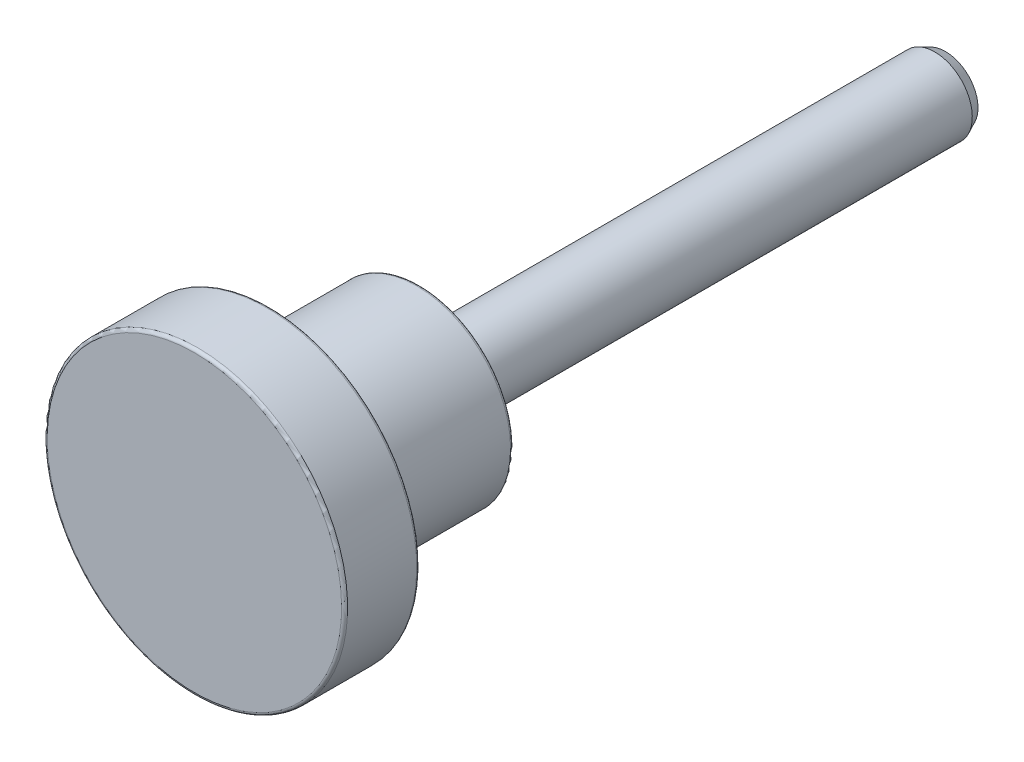
ISO-10303-21;
HEADER;
FILE_DESCRIPTION(('STEP AP214'),'2;1');
FILE_NAME('part.step','',(''),(''),'','','');
FILE_SCHEMA(('AUTOMOTIVE_DESIGN { 1 0 10303 214 1 1 1 1 }'));
ENDSEC;
DATA;
#1=APPLICATION_CONTEXT('core data for automotive mechanical design processes');
#2=APPLICATION_PROTOCOL_DEFINITION('international standard','automotive_design',2000,#1);
#3=PRODUCT_CONTEXT('',#1,'mechanical');
#4=PRODUCT('Part','Part','',(#3));
#5=PRODUCT_RELATED_PRODUCT_CATEGORY('part','',(#4));
#6=PRODUCT_DEFINITION_FORMATION('','',#4);
#7=PRODUCT_DEFINITION_CONTEXT('part definition',#1,'design');
#8=PRODUCT_DEFINITION('design','',#6,#7);
#9=PRODUCT_DEFINITION_SHAPE('','',#8);
#10=(LENGTH_UNIT() NAMED_UNIT(*) SI_UNIT(.MILLI.,.METRE.));
#11=(NAMED_UNIT(*) PLANE_ANGLE_UNIT() SI_UNIT($,.RADIAN.));
#12=(NAMED_UNIT(*) SI_UNIT($,.STERADIAN.) SOLID_ANGLE_UNIT());
#13=UNCERTAINTY_MEASURE_WITH_UNIT(LENGTH_MEASURE(1.E-05),#10,'distance_accuracy_value','');
#14=(GEOMETRIC_REPRESENTATION_CONTEXT(3) GLOBAL_UNCERTAINTY_ASSIGNED_CONTEXT((#13)) GLOBAL_UNIT_ASSIGNED_CONTEXT((#10,
#11,#12)) REPRESENTATION_CONTEXT('',''));
#15=CARTESIAN_POINT('',(0.,0.,0.));
#16=DIRECTION('',(0.,0.,1.));
#17=DIRECTION('',(1.,0.,0.));
#18=AXIS2_PLACEMENT_3D('',#15,#16,#17);
#19=CARTESIAN_POINT('',(0.,0.,8.5598));
#20=DIRECTION('',(0.,0.,-1.));
#21=DIRECTION('',(0.,1.,0.));
#22=AXIS2_PLACEMENT_3D('',#19,#20,#21);
#23=CYLINDRICAL_SURFACE('',#22,3.175);
#24=CARTESIAN_POINT('',(0.,0.,22.225));
#25=DIRECTION('',(0.,0.,1.));
#26=DIRECTION('',(0.,-1.,0.));
#27=AXIS2_PLACEMENT_3D('',#24,#25,#26);
#28=CIRCLE('',#27,3.175);
#29=CARTESIAN_POINT('',(0.,-3.175,22.225));
#30=VERTEX_POINT('',#29);
#31=EDGE_CURVE('E60',#30,#30,#28,.F.);
#32=ORIENTED_EDGE('',*,*,#31,.T.);
#33=EDGE_LOOP('',(#32));
#34=FACE_BOUND('',#33,.T.);
#35=CARTESIAN_POINT('',(0.,0.,-21.3178571428572));
#36=DIRECTION('',(0.,0.,1.));
#37=DIRECTION('',(0.,-1.,0.));
#38=AXIS2_PLACEMENT_3D('',#35,#36,#37);
#39=CIRCLE('',#38,3.175);
#40=CARTESIAN_POINT('',(0.,-3.17500000000001,-21.3178571428572));
#41=VERTEX_POINT('',#40);
#42=EDGE_CURVE('E69',#41,#41,#39,.T.);
#43=ORIENTED_EDGE('',*,*,#42,.T.);
#44=EDGE_LOOP('',(#43));
#45=FACE_BOUND('',#44,.T.);
#46=ADVANCED_FACE('F34',(#34,#45),#23,.T.);
#47=CARTESIAN_POINT('',(0.,7.9375,22.225));
#48=DIRECTION('',(0.,0.,1.));
#49=DIRECTION('',(0.,-1.,0.));
#50=AXIS2_PLACEMENT_3D('',#47,#48,#49);
#51=PLANE('',#50);
#52=CARTESIAN_POINT('',(0.,0.,22.225));
#53=DIRECTION('',(0.,0.,1.));
#54=DIRECTION('',(0.,-1.,0.));
#55=AXIS2_PLACEMENT_3D('',#52,#53,#54);
#56=CIRCLE('',#55,7.6835);
#57=CARTESIAN_POINT('',(0.,-7.6835,22.225));
#58=VERTEX_POINT('',#57);
#59=EDGE_CURVE('E54',#58,#58,#56,.F.);
#60=ORIENTED_EDGE('',*,*,#59,.T.);
#61=EDGE_LOOP('',(#60));
#62=FACE_BOUND('',#61,.T.);
#63=ORIENTED_EDGE('',*,*,#31,.F.);
#64=EDGE_LOOP('',(#63));
#65=FACE_BOUND('',#64,.T.);
#66=ADVANCED_FACE('F90',(#62,#65),#51,.F.);
#67=CARTESIAN_POINT('',(0.,0.,22.225));
#68=DIRECTION('',(0.,0.,1.));
#69=DIRECTION('',(0.,-1.,0.));
#70=AXIS2_PLACEMENT_3D('',#67,#68,#69);
#71=CYLINDRICAL_SURFACE('',#70,7.9375);
#72=CARTESIAN_POINT('',(0.,0.,22.479));
#73=DIRECTION('',(0.,0.,1.));
#74=DIRECTION('',(0.,-1.,0.));
#75=AXIS2_PLACEMENT_3D('',#72,#73,#74);
#76=CIRCLE('',#75,7.9375);
#77=CARTESIAN_POINT('',(0.,-7.9375,22.479));
#78=VERTEX_POINT('',#77);
#79=EDGE_CURVE('E57',#78,#78,#76,.T.);
#80=ORIENTED_EDGE('',*,*,#79,.T.);
#81=EDGE_LOOP('',(#80));
#82=FACE_BOUND('',#81,.T.);
#83=CARTESIAN_POINT('',(0.,0.,34.925));
#84=DIRECTION('',(0.,0.,1.));
#85=DIRECTION('',(0.,-1.,0.));
#86=AXIS2_PLACEMENT_3D('',#83,#84,#85);
#87=CIRCLE('',#86,7.9375);
#88=CARTESIAN_POINT('',(0.,-7.9375,34.925));
#89=VERTEX_POINT('',#88);
#90=EDGE_CURVE('E63',#89,#89,#87,.T.);
#91=ORIENTED_EDGE('',*,*,#90,.F.);
#92=EDGE_LOOP('',(#91));
#93=FACE_BOUND('',#92,.T.);
#94=ADVANCED_FACE('F96',(#82,#93),#71,.T.);
#95=CARTESIAN_POINT('',(0.,7.9375,34.925));
#96=DIRECTION('',(0.,0.,1.));
#97=DIRECTION('',(0.,-1.,0.));
#98=AXIS2_PLACEMENT_3D('',#95,#96,#97);
#99=PLANE('',#98);
#100=CARTESIAN_POINT('',(0.,0.,34.925));
#101=DIRECTION('',(0.,0.,1.));
#102=DIRECTION('',(0.,-1.,0.));
#103=AXIS2_PLACEMENT_3D('',#100,#101,#102);
#104=CIRCLE('',#103,12.446);
#105=CARTESIAN_POINT('',(0.,-12.446,34.925));
#106=VERTEX_POINT('',#105);
#107=EDGE_CURVE('E41',#106,#106,#104,.F.);
#108=ORIENTED_EDGE('',*,*,#107,.T.);
#109=EDGE_LOOP('',(#108));
#110=FACE_BOUND('',#109,.T.);
#111=ORIENTED_EDGE('',*,*,#90,.T.);
#112=EDGE_LOOP('',(#111));
#113=FACE_BOUND('',#112,.T.);
#114=ADVANCED_FACE('F115',(#110,#113),#99,.F.);
#115=CARTESIAN_POINT('',(0.,0.,22.225));
#116=DIRECTION('',(0.,0.,1.));
#117=DIRECTION('',(0.,-1.,0.));
#118=AXIS2_PLACEMENT_3D('',#115,#116,#117);
#119=CYLINDRICAL_SURFACE('',#118,12.7);
#120=CARTESIAN_POINT('',(0.,0.,35.179));
#121=DIRECTION('',(0.,0.,1.));
#122=DIRECTION('',(0.,-1.,0.));
#123=AXIS2_PLACEMENT_3D('',#120,#121,#122);
#124=CIRCLE('',#123,12.7);
#125=CARTESIAN_POINT('',(0.,-12.7,35.179));
#126=VERTEX_POINT('',#125);
#127=EDGE_CURVE('E45',#126,#126,#124,.T.);
#128=ORIENTED_EDGE('',*,*,#127,.T.);
#129=EDGE_LOOP('',(#128));
#130=FACE_BOUND('',#129,.T.);
#131=CARTESIAN_POINT('',(0.,0.,41.021));
#132=DIRECTION('',(0.,0.,-1.));
#133=DIRECTION('',(0.,1.,0.));
#134=AXIS2_PLACEMENT_3D('',#131,#132,#133);
#135=CIRCLE('',#134,12.7);
#136=CARTESIAN_POINT('',(0.,12.7,41.021));
#137=VERTEX_POINT('',#136);
#138=EDGE_CURVE('E49',#137,#137,#135,.T.);
#139=ORIENTED_EDGE('',*,*,#138,.T.);
#140=EDGE_LOOP('',(#139));
#141=FACE_BOUND('',#140,.T.);
#142=ADVANCED_FACE('F87',(#130,#141),#119,.T.);
#143=CARTESIAN_POINT('',(0.,12.7,41.275));
#144=DIRECTION('',(0.,0.,-1.));
#145=DIRECTION('',(0.,1.,0.));
#146=AXIS2_PLACEMENT_3D('',#143,#144,#145);
#147=PLANE('',#146);
#148=CARTESIAN_POINT('',(0.,0.,41.275));
#149=DIRECTION('',(0.,0.,-1.));
#150=DIRECTION('',(0.,1.,0.));
#151=AXIS2_PLACEMENT_3D('',#148,#149,#150);
#152=CIRCLE('',#151,12.446);
#153=CARTESIAN_POINT('',(0.,12.446,41.275));
#154=VERTEX_POINT('',#153);
#155=EDGE_CURVE('E11',#154,#154,#152,.F.);
#156=ORIENTED_EDGE('',*,*,#155,.T.);
#157=EDGE_LOOP('',(#156));
#158=FACE_BOUND('',#157,.T.);
#159=ADVANCED_FACE('F77',(#158),#147,.F.);
#160=CARTESIAN_POINT('',(0.,0.,-21.3178571428572));
#161=DIRECTION('',(0.,0.,1.));
#162=DIRECTION('',(0.,-1.,0.));
#163=AXIS2_PLACEMENT_3D('',#160,#161,#162);
#164=CONICAL_SURFACE('',#163,3.175,0.436332312998576);
#165=CARTESIAN_POINT('',(0.,0.,-22.225));
#166=DIRECTION('',(0.,0.,1.));
#167=DIRECTION('',(0.,-1.,0.));
#168=AXIS2_PLACEMENT_3D('',#165,#166,#167);
#169=CIRCLE('',#168,2.75199233867369);
#170=CARTESIAN_POINT('',(0.,-2.75199233867369,-22.225));
#171=VERTEX_POINT('',#170);
#172=EDGE_CURVE('E66',#171,#171,#169,.T.);
#173=ORIENTED_EDGE('',*,*,#172,.T.);
#174=EDGE_LOOP('',(#173));
#175=FACE_BOUND('',#174,.T.);
#176=ORIENTED_EDGE('',*,*,#42,.F.);
#177=EDGE_LOOP('',(#176));
#178=FACE_BOUND('',#177,.T.);
#179=ADVANCED_FACE('F74',(#175,#178),#164,.T.);
#180=CARTESIAN_POINT('',(0.,3.175,-22.225));
#181=DIRECTION('',(0.,0.,-1.));
#182=DIRECTION('',(0.,1.,0.));
#183=AXIS2_PLACEMENT_3D('',#180,#181,#182);
#184=PLANE('',#183);
#185=ORIENTED_EDGE('',*,*,#172,.F.);
#186=EDGE_LOOP('',(#185));
#187=FACE_BOUND('',#186,.T.);
#188=ADVANCED_FACE('F76',(#187),#184,.T.);
#189=CARTESIAN_POINT('',(0.,0.,22.479));
#190=DIRECTION('',(0.,0.,1.));
#191=DIRECTION('',(0.,-1.,0.));
#192=AXIS2_PLACEMENT_3D('',#189,#190,#191);
#193=TOROIDAL_SURFACE('',#192,7.6835,0.254);
#194=ORIENTED_EDGE('',*,*,#59,.F.);
#195=EDGE_LOOP('',(#194));
#196=FACE_BOUND('',#195,.T.);
#197=ORIENTED_EDGE('',*,*,#79,.F.);
#198=EDGE_LOOP('',(#197));
#199=FACE_BOUND('',#198,.T.);
#200=ADVANCED_FACE('F84',(#196,#199),#193,.T.);
#201=CARTESIAN_POINT('',(0.,0.,35.179));
#202=DIRECTION('',(0.,0.,1.));
#203=DIRECTION('',(0.,-1.,0.));
#204=AXIS2_PLACEMENT_3D('',#201,#202,#203);
#205=TOROIDAL_SURFACE('',#204,12.446,0.254);
#206=ORIENTED_EDGE('',*,*,#107,.F.);
#207=EDGE_LOOP('',(#206));
#208=FACE_BOUND('',#207,.T.);
#209=ORIENTED_EDGE('',*,*,#127,.F.);
#210=EDGE_LOOP('',(#209));
#211=FACE_BOUND('',#210,.T.);
#212=ADVANCED_FACE('F102',(#208,#211),#205,.T.);
#213=CARTESIAN_POINT('',(0.,0.,41.021));
#214=DIRECTION('',(0.,0.,-1.));
#215=DIRECTION('',(0.,1.,0.));
#216=AXIS2_PLACEMENT_3D('',#213,#214,#215);
#217=TOROIDAL_SURFACE('',#216,12.446,0.254);
#218=ORIENTED_EDGE('',*,*,#138,.F.);
#219=EDGE_LOOP('',(#218));
#220=FACE_BOUND('',#219,.T.);
#221=ORIENTED_EDGE('',*,*,#155,.F.);
#222=EDGE_LOOP('',(#221));
#223=FACE_BOUND('',#222,.T.);
#224=ADVANCED_FACE('F36',(#220,#223),#217,.T.);
#225=CLOSED_SHELL('',(#46,#66,#94,#114,#142,#159,#179,#188,#200,#212,#224));
#226=MANIFOLD_SOLID_BREP('B2',#225);
#227=ADVANCED_BREP_SHAPE_REPRESENTATION('',(#18,#226),#14);
#228=SHAPE_DEFINITION_REPRESENTATION(#9,#227);
ENDSEC;
END-ISO-10303-21;
